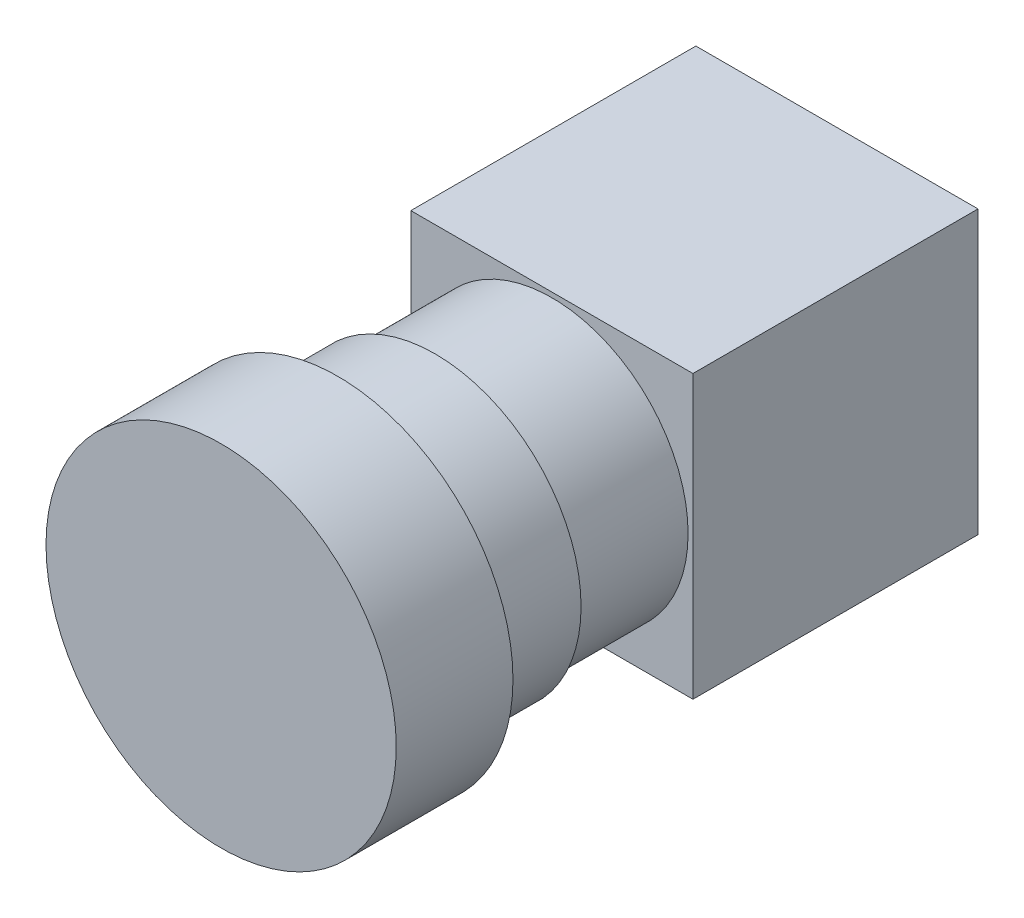
ISO-10303-21;
HEADER;
FILE_DESCRIPTION(('STEP AP214'),'2;1');
FILE_NAME('part.step','',(''),(''),'','','');
FILE_SCHEMA(('AUTOMOTIVE_DESIGN { 1 0 10303 214 1 1 1 1 }'));
ENDSEC;
DATA;
#1=APPLICATION_CONTEXT('core data for automotive mechanical design processes');
#2=APPLICATION_PROTOCOL_DEFINITION('international standard','automotive_design',2000,#1);
#3=PRODUCT_CONTEXT('',#1,'mechanical');
#4=PRODUCT('Part','Part','',(#3));
#5=PRODUCT_RELATED_PRODUCT_CATEGORY('part','',(#4));
#6=PRODUCT_DEFINITION_FORMATION('','',#4);
#7=PRODUCT_DEFINITION_CONTEXT('part definition',#1,'design');
#8=PRODUCT_DEFINITION('design','',#6,#7);
#9=PRODUCT_DEFINITION_SHAPE('','',#8);
#10=(LENGTH_UNIT() NAMED_UNIT(*) SI_UNIT(.MILLI.,.METRE.));
#11=(NAMED_UNIT(*) PLANE_ANGLE_UNIT() SI_UNIT($,.RADIAN.));
#12=(NAMED_UNIT(*) SI_UNIT($,.STERADIAN.) SOLID_ANGLE_UNIT());
#13=UNCERTAINTY_MEASURE_WITH_UNIT(LENGTH_MEASURE(1.E-05),#10,'distance_accuracy_value','');
#14=(GEOMETRIC_REPRESENTATION_CONTEXT(3) GLOBAL_UNCERTAINTY_ASSIGNED_CONTEXT((#13)) GLOBAL_UNIT_ASSIGNED_CONTEXT((#10,
#11,#12)) REPRESENTATION_CONTEXT('',''));
#15=CARTESIAN_POINT('',(0.,0.,0.));
#16=DIRECTION('',(0.,0.,1.));
#17=DIRECTION('',(1.,0.,0.));
#18=AXIS2_PLACEMENT_3D('',#15,#16,#17);
#19=CARTESIAN_POINT('',(14.5,14.5,29.3));
#20=DIRECTION('',(-1.,0.,0.));
#21=DIRECTION('',(0.,-1.,0.));
#22=AXIS2_PLACEMENT_3D('',#19,#20,#21);
#23=PLANE('',#22);
#24=DIRECTION('',(0.,1.,0.));
#25=VECTOR('',#24,1.);
#26=CARTESIAN_POINT('',(14.5,14.5,0.));
#27=LINE('',#26,#25);
#28=CARTESIAN_POINT('',(14.5,-14.5,0.));
#29=VERTEX_POINT('',#28);
#30=CARTESIAN_POINT('',(14.5,14.5,0.));
#31=VERTEX_POINT('',#30);
#32=EDGE_CURVE('E109',#29,#31,#27,.T.);
#33=ORIENTED_EDGE('',*,*,#32,.T.);
#34=DIRECTION('',(0.,0.,-1.));
#35=VECTOR('',#34,1.);
#36=CARTESIAN_POINT('',(14.5,14.5,29.3));
#37=LINE('',#36,#35);
#38=CARTESIAN_POINT('',(14.5,14.5,29.3));
#39=VERTEX_POINT('',#38);
#40=EDGE_CURVE('E46',#39,#31,#37,.T.);
#41=ORIENTED_EDGE('',*,*,#40,.F.);
#42=DIRECTION('',(0.,1.,0.));
#43=VECTOR('',#42,1.);
#44=CARTESIAN_POINT('',(14.5,14.5,29.3));
#45=LINE('',#44,#43);
#46=CARTESIAN_POINT('',(14.5,-14.5,29.3));
#47=VERTEX_POINT('',#46);
#48=EDGE_CURVE('E96',#47,#39,#45,.T.);
#49=ORIENTED_EDGE('',*,*,#48,.F.);
#50=DIRECTION('',(0.,0.,-1.));
#51=VECTOR('',#50,1.);
#52=CARTESIAN_POINT('',(14.5,-14.5,29.3));
#53=LINE('',#52,#51);
#54=EDGE_CURVE('E105',#47,#29,#53,.T.);
#55=ORIENTED_EDGE('',*,*,#54,.T.);
#56=EDGE_LOOP('',(#33,#41,#49,#55));
#57=FACE_BOUND('',#56,.T.);
#58=ADVANCED_FACE('F43',(#57),#23,.F.);
#59=CARTESIAN_POINT('',(-14.5,14.5,29.3));
#60=DIRECTION('',(0.,-1.,0.));
#61=DIRECTION('',(1.,0.,0.));
#62=AXIS2_PLACEMENT_3D('',#59,#60,#61);
#63=PLANE('',#62);
#64=DIRECTION('',(-1.,0.,0.));
#65=VECTOR('',#64,1.);
#66=CARTESIAN_POINT('',(-14.5,14.5,0.));
#67=LINE('',#66,#65);
#68=CARTESIAN_POINT('',(-14.5,14.5,0.));
#69=VERTEX_POINT('',#68);
#70=EDGE_CURVE('E101',#31,#69,#67,.T.);
#71=ORIENTED_EDGE('',*,*,#70,.T.);
#72=DIRECTION('',(0.,0.,-1.));
#73=VECTOR('',#72,1.);
#74=CARTESIAN_POINT('',(-14.5,14.5,29.3));
#75=LINE('',#74,#73);
#76=CARTESIAN_POINT('',(-14.5,14.5,29.3));
#77=VERTEX_POINT('',#76);
#78=EDGE_CURVE('E99',#77,#69,#75,.T.);
#79=ORIENTED_EDGE('',*,*,#78,.F.);
#80=DIRECTION('',(-1.,0.,0.));
#81=VECTOR('',#80,1.);
#82=CARTESIAN_POINT('',(-14.5,14.5,29.3));
#83=LINE('',#82,#81);
#84=EDGE_CURVE('E91',#39,#77,#83,.T.);
#85=ORIENTED_EDGE('',*,*,#84,.F.);
#86=ORIENTED_EDGE('',*,*,#40,.T.);
#87=EDGE_LOOP('',(#71,#79,#85,#86));
#88=FACE_BOUND('',#87,.T.);
#89=ADVANCED_FACE('F100',(#88),#63,.F.);
#90=CARTESIAN_POINT('',(-14.5,14.5,29.3));
#91=DIRECTION('',(1.,0.,0.));
#92=DIRECTION('',(0.,1.,0.));
#93=AXIS2_PLACEMENT_3D('',#90,#91,#92);
#94=PLANE('',#93);
#95=DIRECTION('',(0.,-1.,0.));
#96=VECTOR('',#95,1.);
#97=CARTESIAN_POINT('',(-14.5,14.5,0.));
#98=LINE('',#97,#96);
#99=CARTESIAN_POINT('',(-14.5,-14.5,0.));
#100=VERTEX_POINT('',#99);
#101=EDGE_CURVE('E77',#69,#100,#98,.T.);
#102=ORIENTED_EDGE('',*,*,#101,.T.);
#103=DIRECTION('',(0.,0.,-1.));
#104=VECTOR('',#103,1.);
#105=CARTESIAN_POINT('',(-14.5,-14.5,29.3));
#106=LINE('',#105,#104);
#107=CARTESIAN_POINT('',(-14.5,-14.5,29.3));
#108=VERTEX_POINT('',#107);
#109=EDGE_CURVE('E102',#108,#100,#106,.T.);
#110=ORIENTED_EDGE('',*,*,#109,.F.);
#111=DIRECTION('',(0.,-1.,0.));
#112=VECTOR('',#111,1.);
#113=CARTESIAN_POINT('',(-14.5,14.5,29.3));
#114=LINE('',#113,#112);
#115=EDGE_CURVE('E94',#77,#108,#114,.T.);
#116=ORIENTED_EDGE('',*,*,#115,.F.);
#117=ORIENTED_EDGE('',*,*,#78,.T.);
#118=EDGE_LOOP('',(#102,#110,#116,#117));
#119=FACE_BOUND('',#118,.T.);
#120=ADVANCED_FACE('F103',(#119),#94,.F.);
#121=CARTESIAN_POINT('',(-14.5,-14.5,29.3));
#122=DIRECTION('',(0.,1.,0.));
#123=DIRECTION('',(0.,0.,1.));
#124=AXIS2_PLACEMENT_3D('',#121,#122,#123);
#125=PLANE('',#124);
#126=CARTESIAN_POINT('',(-9.85000000000001,-14.5,26.15));
#127=DIRECTION('',(0.,-1.,0.));
#128=DIRECTION('',(0.,0.,-1.));
#129=AXIS2_PLACEMENT_3D('',#126,#127,#128);
#130=CIRCLE('',#129,1.5);
#131=CARTESIAN_POINT('',(-9.85000000000001,-14.5,24.65));
#132=VERTEX_POINT('',#131);
#133=EDGE_CURVE('E150',#132,#132,#130,.T.);
#134=ORIENTED_EDGE('',*,*,#133,.F.);
#135=EDGE_LOOP('',(#134));
#136=FACE_BOUND('',#135,.T.);
#137=CARTESIAN_POINT('',(9.84999999999999,-14.5,26.15));
#138=DIRECTION('',(0.,-1.,0.));
#139=DIRECTION('',(0.,0.,-1.));
#140=AXIS2_PLACEMENT_3D('',#137,#138,#139);
#141=CIRCLE('',#140,1.5);
#142=CARTESIAN_POINT('',(9.84999999999999,-14.5,24.65));
#143=VERTEX_POINT('',#142);
#144=EDGE_CURVE('E144',#143,#143,#141,.T.);
#145=ORIENTED_EDGE('',*,*,#144,.F.);
#146=EDGE_LOOP('',(#145));
#147=FACE_BOUND('',#146,.T.);
#148=CARTESIAN_POINT('',(0.,-14.5,3.15));
#149=DIRECTION('',(0.,-1.,0.));
#150=DIRECTION('',(0.,0.,-1.));
#151=AXIS2_PLACEMENT_3D('',#148,#149,#150);
#152=CIRCLE('',#151,1.5);
#153=CARTESIAN_POINT('',(0.,-14.5,1.65));
#154=VERTEX_POINT('',#153);
#155=EDGE_CURVE('E138',#154,#154,#152,.T.);
#156=ORIENTED_EDGE('',*,*,#155,.F.);
#157=EDGE_LOOP('',(#156));
#158=FACE_BOUND('',#157,.T.);
#159=DIRECTION('',(1.,0.,0.));
#160=VECTOR('',#159,1.);
#161=CARTESIAN_POINT('',(-14.5,-14.5,0.));
#162=LINE('',#161,#160);
#163=EDGE_CURVE('E83',#100,#29,#162,.T.);
#164=ORIENTED_EDGE('',*,*,#163,.T.);
#165=ORIENTED_EDGE('',*,*,#54,.F.);
#166=DIRECTION('',(1.,0.,0.));
#167=VECTOR('',#166,1.);
#168=CARTESIAN_POINT('',(-14.5,-14.5,29.3));
#169=LINE('',#168,#167);
#170=EDGE_CURVE('E60',#108,#47,#169,.T.);
#171=ORIENTED_EDGE('',*,*,#170,.F.);
#172=ORIENTED_EDGE('',*,*,#109,.T.);
#173=EDGE_LOOP('',(#164,#165,#171,#172));
#174=FACE_BOUND('',#173,.T.);
#175=ADVANCED_FACE('F117',(#136,#147,#158,#174),#125,.F.);
#176=CARTESIAN_POINT('',(0.,0.,29.3));
#177=DIRECTION('',(0.,0.,1.));
#178=DIRECTION('',(1.,0.,0.));
#179=AXIS2_PLACEMENT_3D('',#176,#177,#178);
#180=PLANE('',#179);
#181=CARTESIAN_POINT('',(0.,0.,29.3));
#182=DIRECTION('',(0.,0.,1.));
#183=DIRECTION('',(1.,0.,0.));
#184=AXIS2_PLACEMENT_3D('',#181,#182,#183);
#185=CIRCLE('',#184,14.);
#186=CARTESIAN_POINT('',(14.,0.,29.3));
#187=VERTEX_POINT('',#186);
#188=EDGE_CURVE('E11',#187,#187,#185,.T.);
#189=ORIENTED_EDGE('',*,*,#188,.F.);
#190=EDGE_LOOP('',(#189));
#191=FACE_BOUND('',#190,.T.);
#192=ORIENTED_EDGE('',*,*,#48,.T.);
#193=ORIENTED_EDGE('',*,*,#84,.T.);
#194=ORIENTED_EDGE('',*,*,#115,.T.);
#195=ORIENTED_EDGE('',*,*,#170,.T.);
#196=EDGE_LOOP('',(#192,#193,#194,#195));
#197=FACE_BOUND('',#196,.T.);
#198=ADVANCED_FACE('F92',(#191,#197),#180,.T.);
#199=CARTESIAN_POINT('',(0.,0.,0.));
#200=DIRECTION('',(0.,0.,1.));
#201=DIRECTION('',(1.,0.,0.));
#202=AXIS2_PLACEMENT_3D('',#199,#200,#201);
#203=PLANE('',#202);
#204=ORIENTED_EDGE('',*,*,#32,.F.);
#205=ORIENTED_EDGE('',*,*,#163,.F.);
#206=ORIENTED_EDGE('',*,*,#101,.F.);
#207=ORIENTED_EDGE('',*,*,#70,.F.);
#208=EDGE_LOOP('',(#204,#205,#206,#207));
#209=FACE_BOUND('',#208,.T.);
#210=ADVANCED_FACE('F120',(#209),#203,.F.);
#211=CARTESIAN_POINT('',(0.,0.,41.3));
#212=DIRECTION('',(0.,0.,-1.));
#213=DIRECTION('',(-1.,0.,0.));
#214=AXIS2_PLACEMENT_3D('',#211,#212,#213);
#215=CYLINDRICAL_SURFACE('',#214,14.);
#216=CARTESIAN_POINT('',(0.,0.,41.3));
#217=DIRECTION('',(0.,0.,1.));
#218=DIRECTION('',(1.,0.,0.));
#219=AXIS2_PLACEMENT_3D('',#216,#217,#218);
#220=CIRCLE('',#219,14.);
#221=CARTESIAN_POINT('',(14.,0.,41.3));
#222=VERTEX_POINT('',#221);
#223=EDGE_CURVE('E112',#222,#222,#220,.T.);
#224=ORIENTED_EDGE('',*,*,#223,.F.);
#225=EDGE_LOOP('',(#224));
#226=FACE_BOUND('',#225,.T.);
#227=ORIENTED_EDGE('',*,*,#188,.T.);
#228=EDGE_LOOP('',(#227));
#229=FACE_BOUND('',#228,.T.);
#230=ADVANCED_FACE('F201',(#226,#229),#215,.T.);
#231=CARTESIAN_POINT('',(0.,0.,51.3));
#232=DIRECTION('',(0.,0.,-1.));
#233=DIRECTION('',(-1.,0.,0.));
#234=AXIS2_PLACEMENT_3D('',#231,#232,#233);
#235=CYLINDRICAL_SURFACE('',#234,15.);
#236=CARTESIAN_POINT('',(0.,0.,51.3));
#237=DIRECTION('',(0.,0.,1.));
#238=DIRECTION('',(1.,0.,0.));
#239=AXIS2_PLACEMENT_3D('',#236,#237,#238);
#240=CIRCLE('',#239,15.);
#241=CARTESIAN_POINT('',(15.,0.,51.3));
#242=VERTEX_POINT('',#241);
#243=EDGE_CURVE('E125',#242,#242,#240,.T.);
#244=ORIENTED_EDGE('',*,*,#243,.F.);
#245=EDGE_LOOP('',(#244));
#246=FACE_BOUND('',#245,.T.);
#247=CARTESIAN_POINT('',(0.,0.,41.3));
#248=DIRECTION('',(0.,0.,1.));
#249=DIRECTION('',(1.,0.,0.));
#250=AXIS2_PLACEMENT_3D('',#247,#248,#249);
#251=CIRCLE('',#250,15.);
#252=CARTESIAN_POINT('',(15.,0.,41.3));
#253=VERTEX_POINT('',#252);
#254=EDGE_CURVE('E126',#253,#253,#251,.T.);
#255=ORIENTED_EDGE('',*,*,#254,.T.);
#256=EDGE_LOOP('',(#255));
#257=FACE_BOUND('',#256,.T.);
#258=ADVANCED_FACE('F207',(#246,#257),#235,.T.);
#259=CARTESIAN_POINT('',(0.,0.,41.3));
#260=DIRECTION('',(0.,0.,1.));
#261=DIRECTION('',(1.,0.,0.));
#262=AXIS2_PLACEMENT_3D('',#259,#260,#261);
#263=PLANE('',#262);
#264=ORIENTED_EDGE('',*,*,#223,.T.);
#265=EDGE_LOOP('',(#264));
#266=FACE_BOUND('',#265,.T.);
#267=ORIENTED_EDGE('',*,*,#254,.F.);
#268=EDGE_LOOP('',(#267));
#269=FACE_BOUND('',#268,.T.);
#270=ADVANCED_FACE('F211',(#266,#269),#263,.F.);
#271=CARTESIAN_POINT('',(0.,0.,63.3));
#272=DIRECTION('',(0.,0.,-1.));
#273=DIRECTION('',(-1.,0.,0.));
#274=AXIS2_PLACEMENT_3D('',#271,#272,#273);
#275=CYLINDRICAL_SURFACE('',#274,18.);
#276=CARTESIAN_POINT('',(0.,0.,63.3));
#277=DIRECTION('',(0.,0.,1.));
#278=DIRECTION('',(1.,0.,0.));
#279=AXIS2_PLACEMENT_3D('',#276,#277,#278);
#280=CIRCLE('',#279,18.);
#281=CARTESIAN_POINT('',(18.,0.,63.3));
#282=VERTEX_POINT('',#281);
#283=EDGE_CURVE('E129',#282,#282,#280,.T.);
#284=ORIENTED_EDGE('',*,*,#283,.F.);
#285=EDGE_LOOP('',(#284));
#286=FACE_BOUND('',#285,.T.);
#287=CARTESIAN_POINT('',(0.,0.,51.3));
#288=DIRECTION('',(0.,0.,1.));
#289=DIRECTION('',(1.,0.,0.));
#290=AXIS2_PLACEMENT_3D('',#287,#288,#289);
#291=CIRCLE('',#290,18.);
#292=CARTESIAN_POINT('',(18.,0.,51.3));
#293=VERTEX_POINT('',#292);
#294=EDGE_CURVE('E132',#293,#293,#291,.T.);
#295=ORIENTED_EDGE('',*,*,#294,.T.);
#296=EDGE_LOOP('',(#295));
#297=FACE_BOUND('',#296,.T.);
#298=ADVANCED_FACE('F215',(#286,#297),#275,.T.);
#299=CARTESIAN_POINT('',(0.,0.,63.3));
#300=DIRECTION('',(0.,0.,1.));
#301=DIRECTION('',(1.,0.,0.));
#302=AXIS2_PLACEMENT_3D('',#299,#300,#301);
#303=PLANE('',#302);
#304=ORIENTED_EDGE('',*,*,#283,.T.);
#305=EDGE_LOOP('',(#304));
#306=FACE_BOUND('',#305,.T.);
#307=ADVANCED_FACE('F185',(#306),#303,.T.);
#308=CARTESIAN_POINT('',(0.,0.,51.3));
#309=DIRECTION('',(0.,0.,1.));
#310=DIRECTION('',(1.,0.,0.));
#311=AXIS2_PLACEMENT_3D('',#308,#309,#310);
#312=PLANE('',#311);
#313=ORIENTED_EDGE('',*,*,#243,.T.);
#314=EDGE_LOOP('',(#313));
#315=FACE_BOUND('',#314,.T.);
#316=ORIENTED_EDGE('',*,*,#294,.F.);
#317=EDGE_LOOP('',(#316));
#318=FACE_BOUND('',#317,.T.);
#319=ADVANCED_FACE('F175',(#315,#318),#312,.F.);
#320=CARTESIAN_POINT('',(0.,-9.5,3.15));
#321=DIRECTION('',(0.,-1.,0.));
#322=DIRECTION('',(0.,0.,-1.));
#323=AXIS2_PLACEMENT_3D('',#320,#321,#322);
#324=CYLINDRICAL_SURFACE('',#323,1.5);
#325=CARTESIAN_POINT('',(0.,-9.5,3.15));
#326=DIRECTION('',(0.,-1.,0.));
#327=DIRECTION('',(0.,0.,-1.));
#328=AXIS2_PLACEMENT_3D('',#325,#326,#327);
#329=CIRCLE('',#328,1.5);
#330=CARTESIAN_POINT('',(0.,-9.5,1.65));
#331=VERTEX_POINT('',#330);
#332=EDGE_CURVE('E141',#331,#331,#329,.T.);
#333=ORIENTED_EDGE('',*,*,#332,.F.);
#334=EDGE_LOOP('',(#333));
#335=FACE_BOUND('',#334,.T.);
#336=ORIENTED_EDGE('',*,*,#155,.T.);
#337=EDGE_LOOP('',(#336));
#338=FACE_BOUND('',#337,.T.);
#339=ADVANCED_FACE('F172',(#335,#338),#324,.F.);
#340=CARTESIAN_POINT('',(0.,-9.5,0.));
#341=DIRECTION('',(0.,-1.,0.));
#342=DIRECTION('',(0.,0.,-1.));
#343=AXIS2_PLACEMENT_3D('',#340,#341,#342);
#344=PLANE('',#343);
#345=ORIENTED_EDGE('',*,*,#332,.T.);
#346=EDGE_LOOP('',(#345));
#347=FACE_BOUND('',#346,.T.);
#348=ADVANCED_FACE('F174',(#347),#344,.T.);
#349=CARTESIAN_POINT('',(9.84999999999999,-9.5,26.15));
#350=DIRECTION('',(0.,-1.,0.));
#351=DIRECTION('',(0.,0.,-1.));
#352=AXIS2_PLACEMENT_3D('',#349,#350,#351);
#353=CYLINDRICAL_SURFACE('',#352,1.5);
#354=CARTESIAN_POINT('',(9.84999999999999,-9.5,26.15));
#355=DIRECTION('',(0.,-1.,0.));
#356=DIRECTION('',(0.,0.,-1.));
#357=AXIS2_PLACEMENT_3D('',#354,#355,#356);
#358=CIRCLE('',#357,1.5);
#359=CARTESIAN_POINT('',(9.84999999999999,-9.5,24.65));
#360=VERTEX_POINT('',#359);
#361=EDGE_CURVE('E147',#360,#360,#358,.T.);
#362=ORIENTED_EDGE('',*,*,#361,.F.);
#363=EDGE_LOOP('',(#362));
#364=FACE_BOUND('',#363,.T.);
#365=ORIENTED_EDGE('',*,*,#144,.T.);
#366=EDGE_LOOP('',(#365));
#367=FACE_BOUND('',#366,.T.);
#368=ADVANCED_FACE('F182',(#364,#367),#353,.F.);
#369=CARTESIAN_POINT('',(0.,-9.5,0.));
#370=DIRECTION('',(0.,-1.,0.));
#371=DIRECTION('',(0.,0.,-1.));
#372=AXIS2_PLACEMENT_3D('',#369,#370,#371);
#373=PLANE('',#372);
#374=ORIENTED_EDGE('',*,*,#361,.T.);
#375=EDGE_LOOP('',(#374));
#376=FACE_BOUND('',#375,.T.);
#377=ADVANCED_FACE('F161',(#376),#373,.T.);
#378=CARTESIAN_POINT('',(-9.85000000000001,-9.5,26.15));
#379=DIRECTION('',(0.,-1.,0.));
#380=DIRECTION('',(0.,0.,-1.));
#381=AXIS2_PLACEMENT_3D('',#378,#379,#380);
#382=CYLINDRICAL_SURFACE('',#381,1.5);
#383=CARTESIAN_POINT('',(-9.85000000000001,-9.5,26.15));
#384=DIRECTION('',(0.,-1.,0.));
#385=DIRECTION('',(0.,0.,-1.));
#386=AXIS2_PLACEMENT_3D('',#383,#384,#385);
#387=CIRCLE('',#386,1.5);
#388=CARTESIAN_POINT('',(-9.85000000000001,-9.5,24.65));
#389=VERTEX_POINT('',#388);
#390=EDGE_CURVE('E135',#389,#389,#387,.T.);
#391=ORIENTED_EDGE('',*,*,#390,.F.);
#392=EDGE_LOOP('',(#391));
#393=FACE_BOUND('',#392,.T.);
#394=ORIENTED_EDGE('',*,*,#133,.T.);
#395=EDGE_LOOP('',(#394));
#396=FACE_BOUND('',#395,.T.);
#397=ADVANCED_FACE('F158',(#393,#396),#382,.F.);
#398=CARTESIAN_POINT('',(0.,-9.5,0.));
#399=DIRECTION('',(0.,-1.,0.));
#400=DIRECTION('',(0.,0.,-1.));
#401=AXIS2_PLACEMENT_3D('',#398,#399,#400);
#402=PLANE('',#401);
#403=ORIENTED_EDGE('',*,*,#390,.T.);
#404=EDGE_LOOP('',(#403));
#405=FACE_BOUND('',#404,.T.);
#406=ADVANCED_FACE('F156',(#405),#402,.T.);
#407=CLOSED_SHELL('',(#58,#89,#120,#175,#198,#210,#230,#258,#270,#298,#307,#319,#339,#348,#368,
#377,#397,#406));
#408=MANIFOLD_SOLID_BREP('B2',#407);
#409=ADVANCED_BREP_SHAPE_REPRESENTATION('',(#18,#408),#14);
#410=SHAPE_DEFINITION_REPRESENTATION(#9,#409);
ENDSEC;
END-ISO-10303-21;
